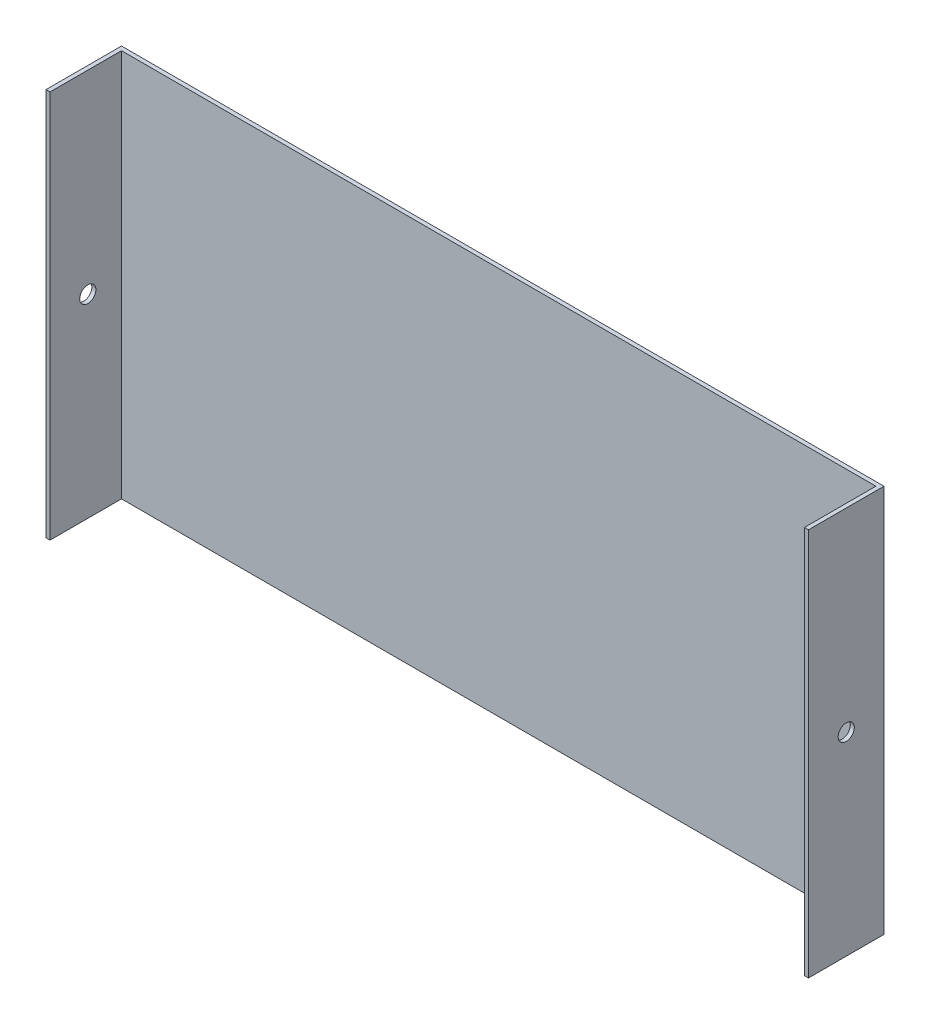
ISO-10303-21;
HEADER;
FILE_DESCRIPTION(('STEP AP214'),'2;1');
FILE_NAME('part.step','',(''),(''),'','','');
FILE_SCHEMA(('AUTOMOTIVE_DESIGN { 1 0 10303 214 1 1 1 1 }'));
ENDSEC;
DATA;
#1=APPLICATION_CONTEXT('core data for automotive mechanical design processes');
#2=APPLICATION_PROTOCOL_DEFINITION('international standard','automotive_design',2000,#1);
#3=PRODUCT_CONTEXT('',#1,'mechanical');
#4=PRODUCT('Part','Part','',(#3));
#5=PRODUCT_RELATED_PRODUCT_CATEGORY('part','',(#4));
#6=PRODUCT_DEFINITION_FORMATION('','',#4);
#7=PRODUCT_DEFINITION_CONTEXT('part definition',#1,'design');
#8=PRODUCT_DEFINITION('design','',#6,#7);
#9=PRODUCT_DEFINITION_SHAPE('','',#8);
#10=(LENGTH_UNIT() NAMED_UNIT(*) SI_UNIT(.MILLI.,.METRE.));
#11=(NAMED_UNIT(*) PLANE_ANGLE_UNIT() SI_UNIT($,.RADIAN.));
#12=(NAMED_UNIT(*) SI_UNIT($,.STERADIAN.) SOLID_ANGLE_UNIT());
#13=UNCERTAINTY_MEASURE_WITH_UNIT(LENGTH_MEASURE(1.E-05),#10,'distance_accuracy_value','');
#14=(GEOMETRIC_REPRESENTATION_CONTEXT(3) GLOBAL_UNCERTAINTY_ASSIGNED_CONTEXT((#13)) GLOBAL_UNIT_ASSIGNED_CONTEXT((#10,
#11,#12)) REPRESENTATION_CONTEXT('',''));
#15=CARTESIAN_POINT('',(0.,0.,0.));
#16=DIRECTION('',(0.,0.,1.));
#17=DIRECTION('',(1.,0.,0.));
#18=AXIS2_PLACEMENT_3D('',#15,#16,#17);
#19=CARTESIAN_POINT('',(0.,304.8,0.));
#20=DIRECTION('',(1.,0.,0.));
#21=DIRECTION('',(0.,0.,-1.));
#22=AXIS2_PLACEMENT_3D('',#19,#20,#21);
#23=PLANE('',#22);
#24=CARTESIAN_POINT('',(0.,152.4,24.3512347090651));
#25=DIRECTION('',(-1.,0.,0.));
#26=DIRECTION('',(0.,0.,1.));
#27=AXIS2_PLACEMENT_3D('',#24,#25,#26);
#28=CIRCLE('',#27,6.35);
#29=CARTESIAN_POINT('',(0.,152.4,30.7012347090651));
#30=VERTEX_POINT('',#29);
#31=EDGE_CURVE('E185',#30,#30,#28,.T.);
#32=ORIENTED_EDGE('',*,*,#31,.F.);
#33=EDGE_LOOP('',(#32));
#34=FACE_BOUND('',#33,.T.);
#35=DIRECTION('',(0.,0.,1.));
#36=VECTOR('',#35,1.);
#37=CARTESIAN_POINT('',(0.,0.,0.));
#38=LINE('',#37,#36);
#39=CARTESIAN_POINT('',(0.,0.,-5.27253058186972));
#40=VERTEX_POINT('',#39);
#41=CARTESIAN_POINT('',(0.,0.,53.975));
#42=VERTEX_POINT('',#41);
#43=EDGE_CURVE('E85',#40,#42,#38,.T.);
#44=ORIENTED_EDGE('',*,*,#43,.T.);
#45=DIRECTION('',(0.,-1.,0.));
#46=VECTOR('',#45,1.);
#47=CARTESIAN_POINT('',(0.,304.8,53.975));
#48=LINE('',#47,#46);
#49=CARTESIAN_POINT('',(0.,304.8,53.975));
#50=VERTEX_POINT('',#49);
#51=EDGE_CURVE('E11',#50,#42,#48,.T.);
#52=ORIENTED_EDGE('',*,*,#51,.F.);
#53=DIRECTION('',(0.,0.,1.));
#54=VECTOR('',#53,1.);
#55=CARTESIAN_POINT('',(0.,304.8,-5.27253058186972));
#56=LINE('',#55,#54);
#57=CARTESIAN_POINT('',(0.,304.8,-5.27253058186972));
#58=VERTEX_POINT('',#57);
#59=EDGE_CURVE('E91',#58,#50,#56,.T.);
#60=ORIENTED_EDGE('',*,*,#59,.F.);
#61=DIRECTION('',(0.,-1.,0.));
#62=VECTOR('',#61,1.);
#63=CARTESIAN_POINT('',(0.,304.8,-5.27253058186972));
#64=LINE('',#63,#62);
#65=EDGE_CURVE('E126',#58,#40,#64,.T.);
#66=ORIENTED_EDGE('',*,*,#65,.T.);
#67=EDGE_LOOP('',(#44,#52,#60,#66));
#68=FACE_BOUND('',#67,.T.);
#69=ADVANCED_FACE('F34',(#34,#68),#23,.F.);
#70=CARTESIAN_POINT('',(0.,304.8,53.975));
#71=DIRECTION('',(0.,0.,-1.));
#72=DIRECTION('',(-1.,0.,0.));
#73=AXIS2_PLACEMENT_3D('',#70,#71,#72);
#74=PLANE('',#73);
#75=DIRECTION('',(1.,0.,0.));
#76=VECTOR('',#75,1.);
#77=CARTESIAN_POINT('',(0.,0.,53.975));
#78=LINE('',#77,#76);
#79=CARTESIAN_POINT('',(3.17500000000001,0.,53.975));
#80=VERTEX_POINT('',#79);
#81=EDGE_CURVE('E131',#42,#80,#78,.T.);
#82=ORIENTED_EDGE('',*,*,#81,.T.);
#83=DIRECTION('',(0.,-1.,0.));
#84=VECTOR('',#83,1.);
#85=CARTESIAN_POINT('',(3.17500000000001,304.8,53.975));
#86=LINE('',#85,#84);
#87=CARTESIAN_POINT('',(3.17500000000001,304.8,53.975));
#88=VERTEX_POINT('',#87);
#89=EDGE_CURVE('E42',#88,#80,#86,.T.);
#90=ORIENTED_EDGE('',*,*,#89,.F.);
#91=DIRECTION('',(1.,0.,0.));
#92=VECTOR('',#91,1.);
#93=CARTESIAN_POINT('',(0.,304.8,53.975));
#94=LINE('',#93,#92);
#95=EDGE_CURVE('E176',#50,#88,#94,.T.);
#96=ORIENTED_EDGE('',*,*,#95,.F.);
#97=ORIENTED_EDGE('',*,*,#51,.T.);
#98=EDGE_LOOP('',(#82,#90,#96,#97));
#99=FACE_BOUND('',#98,.T.);
#100=ADVANCED_FACE('F210',(#99),#74,.F.);
#101=CARTESIAN_POINT('',(3.175,304.8,-2.09753058186972));
#102=DIRECTION('',(-1.,0.,0.));
#103=DIRECTION('',(0.,0.,1.));
#104=AXIS2_PLACEMENT_3D('',#101,#102,#103);
#105=PLANE('',#104);
#106=CARTESIAN_POINT('',(3.17500000000015,152.4,24.3512347090651));
#107=DIRECTION('',(-1.,0.,0.));
#108=DIRECTION('',(0.,0.,1.));
#109=AXIS2_PLACEMENT_3D('',#106,#107,#108);
#110=CIRCLE('',#109,6.35);
#111=CARTESIAN_POINT('',(3.17500000000015,152.4,30.7012347090651));
#112=VERTEX_POINT('',#111);
#113=EDGE_CURVE('E132',#112,#112,#110,.T.);
#114=ORIENTED_EDGE('',*,*,#113,.T.);
#115=EDGE_LOOP('',(#114));
#116=FACE_BOUND('',#115,.T.);
#117=DIRECTION('',(0.,0.,-1.));
#118=VECTOR('',#117,1.);
#119=CARTESIAN_POINT('',(3.175,0.,-2.09753058186972));
#120=LINE('',#119,#118);
#121=CARTESIAN_POINT('',(3.175,0.,-2.09753058186972));
#122=VERTEX_POINT('',#121);
#123=EDGE_CURVE('E134',#80,#122,#120,.T.);
#124=ORIENTED_EDGE('',*,*,#123,.T.);
#125=DIRECTION('',(0.,-1.,0.));
#126=VECTOR('',#125,1.);
#127=CARTESIAN_POINT('',(3.175,304.8,-2.09753058186972));
#128=LINE('',#127,#126);
#129=CARTESIAN_POINT('',(3.175,304.8,-2.09753058186972));
#130=VERTEX_POINT('',#129);
#131=EDGE_CURVE('E151',#130,#122,#128,.T.);
#132=ORIENTED_EDGE('',*,*,#131,.F.);
#133=DIRECTION('',(0.,0.,-1.));
#134=VECTOR('',#133,1.);
#135=CARTESIAN_POINT('',(3.175,304.8,-2.09753058186972));
#136=LINE('',#135,#134);
#137=EDGE_CURVE('E160',#88,#130,#136,.T.);
#138=ORIENTED_EDGE('',*,*,#137,.F.);
#139=ORIENTED_EDGE('',*,*,#89,.T.);
#140=EDGE_LOOP('',(#124,#132,#138,#139));
#141=FACE_BOUND('',#140,.T.);
#142=ADVANCED_FACE('F158',(#116,#141),#105,.F.);
#143=CARTESIAN_POINT('',(3.175,304.8,-2.09753058186972));
#144=DIRECTION('',(0.,0.,-1.));
#145=DIRECTION('',(-1.,0.,0.));
#146=AXIS2_PLACEMENT_3D('',#143,#144,#145);
#147=PLANE('',#146);
#148=DIRECTION('',(1.,0.,0.));
#149=VECTOR('',#148,1.);
#150=CARTESIAN_POINT('',(3.175,0.,-2.09753058186972));
#151=LINE('',#150,#149);
#152=CARTESIAN_POINT('',(595.506256140345,0.,-2.09753058186975));
#153=VERTEX_POINT('',#152);
#154=EDGE_CURVE('E136',#122,#153,#151,.T.);
#155=ORIENTED_EDGE('',*,*,#154,.T.);
#156=DIRECTION('',(0.,-1.,0.));
#157=VECTOR('',#156,1.);
#158=CARTESIAN_POINT('',(595.506256140345,304.8,-2.09753058186975));
#159=LINE('',#158,#157);
#160=CARTESIAN_POINT('',(595.506256140345,304.8,-2.09753058186975));
#161=VERTEX_POINT('',#160);
#162=EDGE_CURVE('E148',#161,#153,#159,.T.);
#163=ORIENTED_EDGE('',*,*,#162,.F.);
#164=DIRECTION('',(1.,0.,0.));
#165=VECTOR('',#164,1.);
#166=CARTESIAN_POINT('',(3.175,304.8,-2.09753058186972));
#167=LINE('',#166,#165);
#168=EDGE_CURVE('E172',#130,#161,#167,.T.);
#169=ORIENTED_EDGE('',*,*,#168,.F.);
#170=ORIENTED_EDGE('',*,*,#131,.T.);
#171=EDGE_LOOP('',(#155,#163,#169,#170));
#172=FACE_BOUND('',#171,.T.);
#173=ADVANCED_FACE('F168',(#172),#147,.F.);
#174=CARTESIAN_POINT('',(595.506256140345,304.8,-2.09753058186975));
#175=DIRECTION('',(1.,0.,0.));
#176=DIRECTION('',(0.,0.,-1.));
#177=AXIS2_PLACEMENT_3D('',#174,#175,#176);
#178=PLANE('',#177);
#179=CARTESIAN_POINT('',(595.506256140345,152.4,24.3512347090651));
#180=DIRECTION('',(1.,0.,0.));
#181=DIRECTION('',(0.,0.,-1.));
#182=AXIS2_PLACEMENT_3D('',#179,#180,#181);
#183=CIRCLE('',#182,6.35);
#184=CARTESIAN_POINT('',(595.506256140345,152.4,18.0012347090651));
#185=VERTEX_POINT('',#184);
#186=EDGE_CURVE('E181',#185,#185,#183,.T.);
#187=ORIENTED_EDGE('',*,*,#186,.T.);
#188=EDGE_LOOP('',(#187));
#189=FACE_BOUND('',#188,.T.);
#190=DIRECTION('',(0.,0.,1.));
#191=VECTOR('',#190,1.);
#192=CARTESIAN_POINT('',(595.506256140345,0.,-2.09753058186975));
#193=LINE('',#192,#191);
#194=CARTESIAN_POINT('',(595.506256140345,0.,53.9749999999998));
#195=VERTEX_POINT('',#194);
#196=EDGE_CURVE('E138',#153,#195,#193,.T.);
#197=ORIENTED_EDGE('',*,*,#196,.T.);
#198=DIRECTION('',(0.,-1.,0.));
#199=VECTOR('',#198,1.);
#200=CARTESIAN_POINT('',(595.506256140345,304.8,53.9749999999998));
#201=LINE('',#200,#199);
#202=CARTESIAN_POINT('',(595.506256140345,304.8,53.9749999999998));
#203=VERTEX_POINT('',#202);
#204=EDGE_CURVE('E121',#203,#195,#201,.T.);
#205=ORIENTED_EDGE('',*,*,#204,.F.);
#206=DIRECTION('',(0.,0.,1.));
#207=VECTOR('',#206,1.);
#208=CARTESIAN_POINT('',(595.506256140345,304.8,-2.09753058186975));
#209=LINE('',#208,#207);
#210=EDGE_CURVE('E111',#161,#203,#209,.T.);
#211=ORIENTED_EDGE('',*,*,#210,.F.);
#212=ORIENTED_EDGE('',*,*,#162,.T.);
#213=EDGE_LOOP('',(#197,#205,#211,#212));
#214=FACE_BOUND('',#213,.T.);
#215=ADVANCED_FACE('F171',(#189,#214),#178,.F.);
#216=CARTESIAN_POINT('',(598.681256140345,304.8,53.9749999999998));
#217=DIRECTION('',(0.,0.,-1.));
#218=DIRECTION('',(-1.,0.,0.));
#219=AXIS2_PLACEMENT_3D('',#216,#217,#218);
#220=PLANE('',#219);
#221=DIRECTION('',(1.,0.,0.));
#222=VECTOR('',#221,1.);
#223=CARTESIAN_POINT('',(598.681256140345,0.,53.9749999999998));
#224=LINE('',#223,#222);
#225=CARTESIAN_POINT('',(598.681256140345,0.,53.9749999999998));
#226=VERTEX_POINT('',#225);
#227=EDGE_CURVE('E120',#195,#226,#224,.T.);
#228=ORIENTED_EDGE('',*,*,#227,.T.);
#229=DIRECTION('',(0.,-1.,0.));
#230=VECTOR('',#229,1.);
#231=CARTESIAN_POINT('',(598.681256140345,304.8,53.9749999999998));
#232=LINE('',#231,#230);
#233=CARTESIAN_POINT('',(598.681256140345,304.8,53.9749999999998));
#234=VERTEX_POINT('',#233);
#235=EDGE_CURVE('E117',#234,#226,#232,.T.);
#236=ORIENTED_EDGE('',*,*,#235,.F.);
#237=DIRECTION('',(1.,0.,0.));
#238=VECTOR('',#237,1.);
#239=CARTESIAN_POINT('',(598.681256140345,304.8,53.9749999999998));
#240=LINE('',#239,#238);
#241=EDGE_CURVE('E105',#203,#234,#240,.T.);
#242=ORIENTED_EDGE('',*,*,#241,.F.);
#243=ORIENTED_EDGE('',*,*,#204,.T.);
#244=EDGE_LOOP('',(#228,#236,#242,#243));
#245=FACE_BOUND('',#244,.T.);
#246=ADVANCED_FACE('F118',(#245),#220,.F.);
#247=CARTESIAN_POINT('',(598.681256140345,304.8,-1.83293271010448E-13));
#248=DIRECTION('',(-1.,0.,0.));
#249=DIRECTION('',(0.,0.,1.));
#250=AXIS2_PLACEMENT_3D('',#247,#248,#249);
#251=PLANE('',#250);
#252=CARTESIAN_POINT('',(598.681256140345,152.4,24.3512347090651));
#253=DIRECTION('',(-1.,0.,0.));
#254=DIRECTION('',(0.,0.,1.));
#255=AXIS2_PLACEMENT_3D('',#252,#253,#254);
#256=CIRCLE('',#255,6.35);
#257=CARTESIAN_POINT('',(598.681256140345,152.4,30.7012347090651));
#258=VERTEX_POINT('',#257);
#259=EDGE_CURVE('E184',#258,#258,#256,.T.);
#260=ORIENTED_EDGE('',*,*,#259,.T.);
#261=EDGE_LOOP('',(#260));
#262=FACE_BOUND('',#261,.T.);
#263=DIRECTION('',(0.,0.,-1.));
#264=VECTOR('',#263,1.);
#265=CARTESIAN_POINT('',(598.681256140345,0.,-1.83293271010448E-13));
#266=LINE('',#265,#264);
#267=CARTESIAN_POINT('',(598.681256140345,0.,-5.27253058186972));
#268=VERTEX_POINT('',#267);
#269=EDGE_CURVE('E78',#226,#268,#266,.T.);
#270=ORIENTED_EDGE('',*,*,#269,.T.);
#271=DIRECTION('',(0.,-1.,0.));
#272=VECTOR('',#271,1.);
#273=CARTESIAN_POINT('',(598.681256140345,304.8,-5.27253058186972));
#274=LINE('',#273,#272);
#275=CARTESIAN_POINT('',(598.681256140345,304.8,-5.27253058186972));
#276=VERTEX_POINT('',#275);
#277=EDGE_CURVE('E122',#276,#268,#274,.T.);
#278=ORIENTED_EDGE('',*,*,#277,.F.);
#279=DIRECTION('',(0.,0.,-1.));
#280=VECTOR('',#279,1.);
#281=CARTESIAN_POINT('',(598.681256140345,304.8,-1.83293271010448E-13));
#282=LINE('',#281,#280);
#283=EDGE_CURVE('E109',#234,#276,#282,.T.);
#284=ORIENTED_EDGE('',*,*,#283,.F.);
#285=ORIENTED_EDGE('',*,*,#235,.T.);
#286=EDGE_LOOP('',(#270,#278,#284,#285));
#287=FACE_BOUND('',#286,.T.);
#288=ADVANCED_FACE('F124',(#262,#287),#251,.F.);
#289=CARTESIAN_POINT('',(598.681256140345,304.8,-5.27253058186972));
#290=DIRECTION('',(0.,0.,1.));
#291=DIRECTION('',(1.,0.,0.));
#292=AXIS2_PLACEMENT_3D('',#289,#290,#291);
#293=PLANE('',#292);
#294=DIRECTION('',(-1.,0.,0.));
#295=VECTOR('',#294,1.);
#296=CARTESIAN_POINT('',(598.681256140345,0.,-5.27253058186972));
#297=LINE('',#296,#295);
#298=EDGE_CURVE('E142',#268,#40,#297,.T.);
#299=ORIENTED_EDGE('',*,*,#298,.T.);
#300=ORIENTED_EDGE('',*,*,#65,.F.);
#301=DIRECTION('',(-1.,0.,0.));
#302=VECTOR('',#301,1.);
#303=CARTESIAN_POINT('',(598.681256140345,304.8,-5.27253058186972));
#304=LINE('',#303,#302);
#305=EDGE_CURVE('E50',#276,#58,#304,.T.);
#306=ORIENTED_EDGE('',*,*,#305,.F.);
#307=ORIENTED_EDGE('',*,*,#277,.T.);
#308=EDGE_LOOP('',(#299,#300,#306,#307));
#309=FACE_BOUND('',#308,.T.);
#310=ADVANCED_FACE('F219',(#309),#293,.F.);
#311=CARTESIAN_POINT('',(0.,304.8,0.));
#312=DIRECTION('',(0.,1.,0.));
#313=DIRECTION('',(0.,0.,1.));
#314=AXIS2_PLACEMENT_3D('',#311,#312,#313);
#315=PLANE('',#314);
#316=ORIENTED_EDGE('',*,*,#59,.T.);
#317=ORIENTED_EDGE('',*,*,#95,.T.);
#318=ORIENTED_EDGE('',*,*,#137,.T.);
#319=ORIENTED_EDGE('',*,*,#168,.T.);
#320=ORIENTED_EDGE('',*,*,#210,.T.);
#321=ORIENTED_EDGE('',*,*,#241,.T.);
#322=ORIENTED_EDGE('',*,*,#283,.T.);
#323=ORIENTED_EDGE('',*,*,#305,.T.);
#324=EDGE_LOOP('',(#316,#317,#318,#319,#320,#321,#322,#323));
#325=FACE_BOUND('',#324,.T.);
#326=ADVANCED_FACE('F107',(#325),#315,.T.);
#327=CARTESIAN_POINT('',(0.,0.,0.));
#328=DIRECTION('',(0.,1.,0.));
#329=DIRECTION('',(0.,0.,1.));
#330=AXIS2_PLACEMENT_3D('',#327,#328,#329);
#331=PLANE('',#330);
#332=ORIENTED_EDGE('',*,*,#43,.F.);
#333=ORIENTED_EDGE('',*,*,#298,.F.);
#334=ORIENTED_EDGE('',*,*,#269,.F.);
#335=ORIENTED_EDGE('',*,*,#227,.F.);
#336=ORIENTED_EDGE('',*,*,#196,.F.);
#337=ORIENTED_EDGE('',*,*,#154,.F.);
#338=ORIENTED_EDGE('',*,*,#123,.F.);
#339=ORIENTED_EDGE('',*,*,#81,.F.);
#340=EDGE_LOOP('',(#332,#333,#334,#335,#336,#337,#338,#339));
#341=FACE_BOUND('',#340,.T.);
#342=ADVANCED_FACE('F164',(#341),#331,.F.);
#343=CARTESIAN_POINT('',(598.681256140345,152.4,24.3512347090651));
#344=DIRECTION('',(-1.,0.,0.));
#345=DIRECTION('',(0.,0.,1.));
#346=AXIS2_PLACEMENT_3D('',#343,#344,#345);
#347=CYLINDRICAL_SURFACE('',#346,6.35);
#348=ORIENTED_EDGE('',*,*,#259,.F.);
#349=EDGE_LOOP('',(#348));
#350=FACE_BOUND('',#349,.T.);
#351=ORIENTED_EDGE('',*,*,#186,.F.);
#352=EDGE_LOOP('',(#351));
#353=FACE_BOUND('',#352,.T.);
#354=ADVANCED_FACE('F192',(#350,#353),#347,.F.);
#355=ORIENTED_EDGE('',*,*,#31,.T.);
#356=EDGE_LOOP('',(#355));
#357=FACE_BOUND('',#356,.T.);
#358=ORIENTED_EDGE('',*,*,#113,.F.);
#359=EDGE_LOOP('',(#358));
#360=FACE_BOUND('',#359,.T.);
#361=ADVANCED_FACE('F195',(#357,#360),#347,.F.);
#362=CLOSED_SHELL('',(#69,#100,#142,#173,#215,#246,#288,#310,#326,#342,#354,#361));
#363=MANIFOLD_SOLID_BREP('B2',#362);
#364=ADVANCED_BREP_SHAPE_REPRESENTATION('',(#18,#363),#14);
#365=SHAPE_DEFINITION_REPRESENTATION(#9,#364);
ENDSEC;
END-ISO-10303-21;
